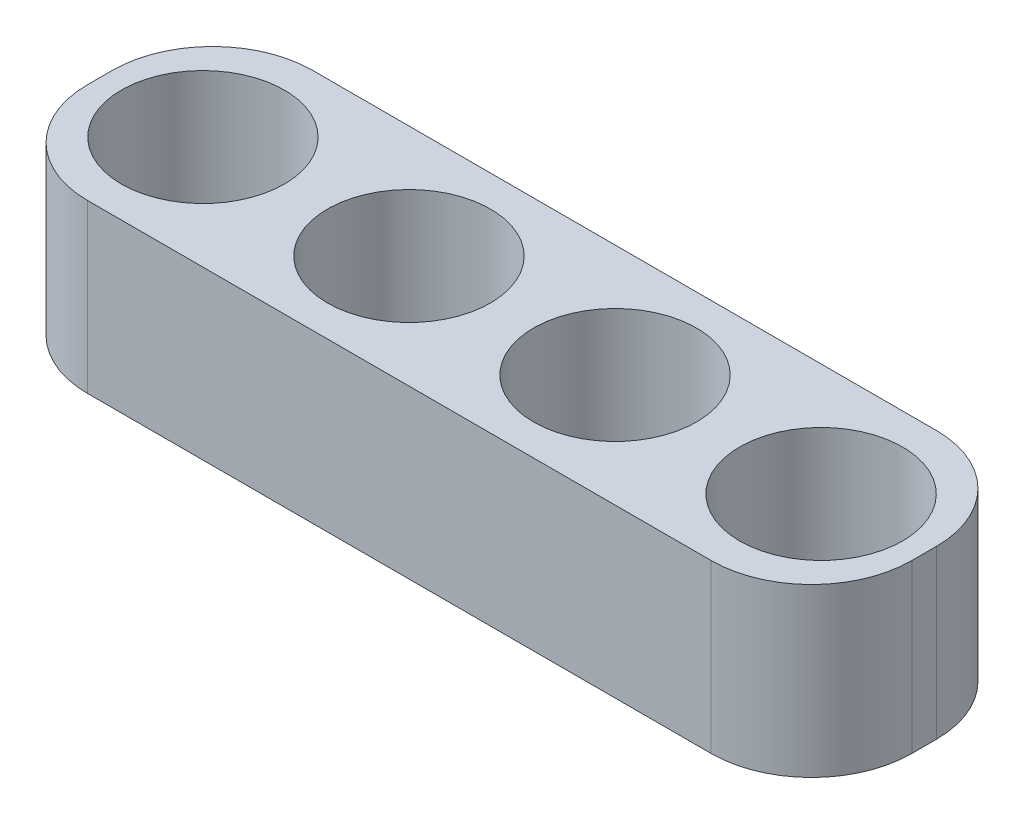
ISO-10303-21;
HEADER;
FILE_DESCRIPTION(('STEP AP214'),'2;1');
FILE_NAME('part.step','',(''),(''),'','','');
FILE_SCHEMA(('AUTOMOTIVE_DESIGN { 1 0 10303 214 1 1 1 1 }'));
ENDSEC;
DATA;
#1=APPLICATION_CONTEXT('core data for automotive mechanical design processes');
#2=APPLICATION_PROTOCOL_DEFINITION('international standard','automotive_design',2000,#1);
#3=PRODUCT_CONTEXT('',#1,'mechanical');
#4=PRODUCT('Part','Part','',(#3));
#5=PRODUCT_RELATED_PRODUCT_CATEGORY('part','',(#4));
#6=PRODUCT_DEFINITION_FORMATION('','',#4);
#7=PRODUCT_DEFINITION_CONTEXT('part definition',#1,'design');
#8=PRODUCT_DEFINITION('design','',#6,#7);
#9=PRODUCT_DEFINITION_SHAPE('','',#8);
#10=(LENGTH_UNIT() NAMED_UNIT(*) SI_UNIT(.MILLI.,.METRE.));
#11=(NAMED_UNIT(*) PLANE_ANGLE_UNIT() SI_UNIT($,.RADIAN.));
#12=(NAMED_UNIT(*) SI_UNIT($,.STERADIAN.) SOLID_ANGLE_UNIT());
#13=UNCERTAINTY_MEASURE_WITH_UNIT(LENGTH_MEASURE(1.E-05),#10,'distance_accuracy_value','');
#14=(GEOMETRIC_REPRESENTATION_CONTEXT(3) GLOBAL_UNCERTAINTY_ASSIGNED_CONTEXT((#13)) GLOBAL_UNIT_ASSIGNED_CONTEXT((#10,
#11,#12)) REPRESENTATION_CONTEXT('',''));
#15=CARTESIAN_POINT('',(0.,0.,0.));
#16=DIRECTION('',(0.,0.,1.));
#17=DIRECTION('',(1.,0.,0.));
#18=AXIS2_PLACEMENT_3D('',#15,#16,#17);
#19=CARTESIAN_POINT('',(0.,20.,13.4766099979274));
#20=DIRECTION('',(0.,0.,-1.));
#21=DIRECTION('',(-1.,0.,0.));
#22=AXIS2_PLACEMENT_3D('',#19,#20,#21);
#23=PLANE('',#22);
#24=DIRECTION('',(1.,0.,0.));
#25=VECTOR('',#24,1.);
#26=CARTESIAN_POINT('',(0.,0.,13.4766099979274));
#27=LINE('',#26,#25);
#28=CARTESIAN_POINT('',(-37.3186578647555,0.,13.4766099979274));
#29=VERTEX_POINT('',#28);
#30=CARTESIAN_POINT('',(37.3186578647554,0.,13.4766099979274));
#31=VERTEX_POINT('',#30);
#32=EDGE_CURVE('E138',#29,#31,#27,.T.);
#33=ORIENTED_EDGE('',*,*,#32,.T.);
#34=DIRECTION('',(0.,-1.,0.));
#35=VECTOR('',#34,1.);
#36=CARTESIAN_POINT('',(37.3186578647554,20.,13.4766099979274));
#37=LINE('',#36,#35);
#38=CARTESIAN_POINT('',(37.3186578647554,20.,13.4766099979274));
#39=VERTEX_POINT('',#38);
#40=EDGE_CURVE('E112',#31,#39,#37,.F.);
#41=ORIENTED_EDGE('',*,*,#40,.T.);
#42=DIRECTION('',(1.,0.,0.));
#43=VECTOR('',#42,1.);
#44=CARTESIAN_POINT('',(0.,20.,13.4766099979274));
#45=LINE('',#44,#43);
#46=CARTESIAN_POINT('',(-37.3186578647555,20.,13.4766099979274));
#47=VERTEX_POINT('',#46);
#48=EDGE_CURVE('E202',#47,#39,#45,.T.);
#49=ORIENTED_EDGE('',*,*,#48,.F.);
#50=DIRECTION('',(0.,-1.,0.));
#51=VECTOR('',#50,1.);
#52=CARTESIAN_POINT('',(-37.3186578647555,0.,13.4766099979274));
#53=LINE('',#52,#51);
#54=EDGE_CURVE('E118',#47,#29,#53,.T.);
#55=ORIENTED_EDGE('',*,*,#54,.T.);
#56=EDGE_LOOP('',(#33,#41,#49,#55));
#57=FACE_BOUND('',#56,.T.);
#58=ADVANCED_FACE('F41',(#57),#23,.F.);
#59=CARTESIAN_POINT('',(49.3186578647554,20.,0.));
#60=DIRECTION('',(-1.,0.,0.));
#61=DIRECTION('',(0.,0.,1.));
#62=AXIS2_PLACEMENT_3D('',#59,#60,#61);
#63=PLANE('',#62);
#64=DIRECTION('',(0.,0.,-1.));
#65=VECTOR('',#64,1.);
#66=CARTESIAN_POINT('',(49.3186578647554,20.,0.));
#67=LINE('',#66,#65);
#68=CARTESIAN_POINT('',(49.3186578647554,20.,1.47660999792736));
#69=VERTEX_POINT('',#68);
#70=CARTESIAN_POINT('',(49.3186578647554,20.,-1.47660999792736));
#71=VERTEX_POINT('',#70);
#72=EDGE_CURVE('E128',#69,#71,#67,.T.);
#73=ORIENTED_EDGE('',*,*,#72,.F.);
#74=DIRECTION('',(0.,-1.,0.));
#75=VECTOR('',#74,1.);
#76=CARTESIAN_POINT('',(49.3186578647554,20.,1.47660999792736));
#77=LINE('',#76,#75);
#78=CARTESIAN_POINT('',(49.3186578647554,0.,1.47660999792736));
#79=VERTEX_POINT('',#78);
#80=EDGE_CURVE('E111',#69,#79,#77,.T.);
#81=ORIENTED_EDGE('',*,*,#80,.T.);
#82=DIRECTION('',(0.,0.,-1.));
#83=VECTOR('',#82,1.);
#84=CARTESIAN_POINT('',(49.3186578647554,0.,0.));
#85=LINE('',#84,#83);
#86=CARTESIAN_POINT('',(49.3186578647554,0.,-1.47660999792736));
#87=VERTEX_POINT('',#86);
#88=EDGE_CURVE('E125',#79,#87,#85,.T.);
#89=ORIENTED_EDGE('',*,*,#88,.T.);
#90=DIRECTION('',(0.,-1.,0.));
#91=VECTOR('',#90,1.);
#92=CARTESIAN_POINT('',(49.3186578647554,20.,-1.47660999792736));
#93=LINE('',#92,#91);
#94=EDGE_CURVE('E131',#87,#71,#93,.F.);
#95=ORIENTED_EDGE('',*,*,#94,.T.);
#96=EDGE_LOOP('',(#73,#81,#89,#95));
#97=FACE_BOUND('',#96,.T.);
#98=ADVANCED_FACE('F124',(#97),#63,.F.);
#99=CARTESIAN_POINT('',(0.,20.,-13.4766099979274));
#100=DIRECTION('',(0.,0.,-1.));
#101=DIRECTION('',(-1.,0.,0.));
#102=AXIS2_PLACEMENT_3D('',#99,#100,#101);
#103=PLANE('',#102);
#104=DIRECTION('',(1.,0.,0.));
#105=VECTOR('',#104,1.);
#106=CARTESIAN_POINT('',(0.,20.,-13.4766099979274));
#107=LINE('',#106,#105);
#108=CARTESIAN_POINT('',(-37.3186578647555,20.,-13.4766099979274));
#109=VERTEX_POINT('',#108);
#110=CARTESIAN_POINT('',(37.3186578647554,20.,-13.4766099979274));
#111=VERTEX_POINT('',#110);
#112=EDGE_CURVE('E208',#109,#111,#107,.T.);
#113=ORIENTED_EDGE('',*,*,#112,.T.);
#114=DIRECTION('',(0.,-1.,0.));
#115=VECTOR('',#114,1.);
#116=CARTESIAN_POINT('',(37.3186578647554,0.,-13.4766099979274));
#117=LINE('',#116,#115);
#118=CARTESIAN_POINT('',(37.3186578647554,0.,-13.4766099979274));
#119=VERTEX_POINT('',#118);
#120=EDGE_CURVE('E185',#111,#119,#117,.T.);
#121=ORIENTED_EDGE('',*,*,#120,.T.);
#122=DIRECTION('',(1.,0.,0.));
#123=VECTOR('',#122,1.);
#124=CARTESIAN_POINT('',(0.,0.,-13.4766099979274));
#125=LINE('',#124,#123);
#126=CARTESIAN_POINT('',(-37.3186578647555,0.,-13.4766099979274));
#127=VERTEX_POINT('',#126);
#128=EDGE_CURVE('E137',#127,#119,#125,.T.);
#129=ORIENTED_EDGE('',*,*,#128,.F.);
#130=DIRECTION('',(0.,-1.,0.));
#131=VECTOR('',#130,1.);
#132=CARTESIAN_POINT('',(-37.3186578647555,20.,-13.4766099979274));
#133=LINE('',#132,#131);
#134=EDGE_CURVE('E182',#127,#109,#133,.F.);
#135=ORIENTED_EDGE('',*,*,#134,.T.);
#136=EDGE_LOOP('',(#113,#121,#129,#135));
#137=FACE_BOUND('',#136,.T.);
#138=ADVANCED_FACE('F247',(#137),#103,.T.);
#139=CARTESIAN_POINT('',(-49.3186578647555,20.,0.));
#140=DIRECTION('',(-1.,0.,0.));
#141=DIRECTION('',(0.,0.,1.));
#142=AXIS2_PLACEMENT_3D('',#139,#140,#141);
#143=PLANE('',#142);
#144=DIRECTION('',(0.,0.,-1.));
#145=VECTOR('',#144,1.);
#146=CARTESIAN_POINT('',(-49.3186578647555,0.,0.));
#147=LINE('',#146,#145);
#148=CARTESIAN_POINT('',(-49.3186578647555,0.,1.47660999792736));
#149=VERTEX_POINT('',#148);
#150=CARTESIAN_POINT('',(-49.3186578647555,0.,-1.47660999792736));
#151=VERTEX_POINT('',#150);
#152=EDGE_CURVE('E142',#149,#151,#147,.T.);
#153=ORIENTED_EDGE('',*,*,#152,.F.);
#154=DIRECTION('',(0.,-1.,0.));
#155=VECTOR('',#154,1.);
#156=CARTESIAN_POINT('',(-49.3186578647555,20.,1.47660999792736));
#157=LINE('',#156,#155);
#158=CARTESIAN_POINT('',(-49.3186578647555,20.,1.47660999792736));
#159=VERTEX_POINT('',#158);
#160=EDGE_CURVE('E11',#149,#159,#157,.F.);
#161=ORIENTED_EDGE('',*,*,#160,.T.);
#162=DIRECTION('',(0.,0.,-1.));
#163=VECTOR('',#162,1.);
#164=CARTESIAN_POINT('',(-49.3186578647555,20.,0.));
#165=LINE('',#164,#163);
#166=CARTESIAN_POINT('',(-49.3186578647555,20.,-1.47660999792736));
#167=VERTEX_POINT('',#166);
#168=EDGE_CURVE('E192',#159,#167,#165,.T.);
#169=ORIENTED_EDGE('',*,*,#168,.T.);
#170=DIRECTION('',(0.,-1.,0.));
#171=VECTOR('',#170,1.);
#172=CARTESIAN_POINT('',(-49.3186578647555,20.,-1.47660999792736));
#173=LINE('',#172,#171);
#174=EDGE_CURVE('E50',#167,#151,#173,.T.);
#175=ORIENTED_EDGE('',*,*,#174,.T.);
#176=EDGE_LOOP('',(#153,#161,#169,#175));
#177=FACE_BOUND('',#176,.T.);
#178=ADVANCED_FACE('F191',(#177),#143,.T.);
#179=CARTESIAN_POINT('',(-12.3296644661889,20.,0.));
#180=DIRECTION('',(0.,-1.,0.));
#181=DIRECTION('',(0.,0.,-1.));
#182=AXIS2_PLACEMENT_3D('',#179,#180,#181);
#183=CYLINDRICAL_SURFACE('',#182,9.75);
#184=CARTESIAN_POINT('',(-12.3296644661889,20.,0.));
#185=DIRECTION('',(0.,1.,0.));
#186=DIRECTION('',(0.,0.,1.));
#187=AXIS2_PLACEMENT_3D('',#184,#185,#186);
#188=CIRCLE('',#187,9.75);
#189=CARTESIAN_POINT('',(-12.3296644661889,20.,9.75));
#190=VERTEX_POINT('',#189);
#191=EDGE_CURVE('E204',#190,#190,#188,.T.);
#192=ORIENTED_EDGE('',*,*,#191,.T.);
#193=EDGE_LOOP('',(#192));
#194=FACE_BOUND('',#193,.T.);
#195=CARTESIAN_POINT('',(-12.3296644661889,0.,0.));
#196=DIRECTION('',(0.,1.,0.));
#197=DIRECTION('',(0.,0.,1.));
#198=AXIS2_PLACEMENT_3D('',#195,#196,#197);
#199=CIRCLE('',#198,9.75);
#200=CARTESIAN_POINT('',(-12.3296644661889,0.,9.75));
#201=VERTEX_POINT('',#200);
#202=EDGE_CURVE('E144',#201,#201,#199,.T.);
#203=ORIENTED_EDGE('',*,*,#202,.F.);
#204=EDGE_LOOP('',(#203));
#205=FACE_BOUND('',#204,.T.);
#206=ADVANCED_FACE('F235',(#194,#205),#183,.F.);
#207=CARTESIAN_POINT('',(12.3296644661889,20.,0.));
#208=DIRECTION('',(0.,-1.,0.));
#209=DIRECTION('',(0.,0.,-1.));
#210=AXIS2_PLACEMENT_3D('',#207,#208,#209);
#211=CYLINDRICAL_SURFACE('',#210,9.75);
#212=CARTESIAN_POINT('',(12.3296644661889,20.,0.));
#213=DIRECTION('',(0.,1.,0.));
#214=DIRECTION('',(0.,0.,1.));
#215=AXIS2_PLACEMENT_3D('',#212,#213,#214);
#216=CIRCLE('',#215,9.75);
#217=CARTESIAN_POINT('',(12.3296644661889,20.,9.75));
#218=VERTEX_POINT('',#217);
#219=EDGE_CURVE('E211',#218,#218,#216,.T.);
#220=ORIENTED_EDGE('',*,*,#219,.T.);
#221=EDGE_LOOP('',(#220));
#222=FACE_BOUND('',#221,.T.);
#223=CARTESIAN_POINT('',(12.3296644661889,0.,0.));
#224=DIRECTION('',(0.,1.,0.));
#225=DIRECTION('',(0.,0.,1.));
#226=AXIS2_PLACEMENT_3D('',#223,#224,#225);
#227=CIRCLE('',#226,9.75);
#228=CARTESIAN_POINT('',(12.3296644661889,0.,9.75));
#229=VERTEX_POINT('',#228);
#230=EDGE_CURVE('E227',#229,#229,#227,.T.);
#231=ORIENTED_EDGE('',*,*,#230,.F.);
#232=EDGE_LOOP('',(#231));
#233=FACE_BOUND('',#232,.T.);
#234=ADVANCED_FACE('F237',(#222,#233),#211,.F.);
#235=CARTESIAN_POINT('',(36.9889933985666,20.,0.));
#236=DIRECTION('',(0.,-1.,0.));
#237=DIRECTION('',(0.,0.,-1.));
#238=AXIS2_PLACEMENT_3D('',#235,#236,#237);
#239=CYLINDRICAL_SURFACE('',#238,9.75);
#240=CARTESIAN_POINT('',(36.9889933985666,20.,0.));
#241=DIRECTION('',(0.,1.,0.));
#242=DIRECTION('',(0.,0.,1.));
#243=AXIS2_PLACEMENT_3D('',#240,#241,#242);
#244=CIRCLE('',#243,9.75);
#245=CARTESIAN_POINT('',(36.9889933985666,20.,9.75));
#246=VERTEX_POINT('',#245);
#247=EDGE_CURVE('E155',#246,#246,#244,.T.);
#248=ORIENTED_EDGE('',*,*,#247,.T.);
#249=EDGE_LOOP('',(#248));
#250=FACE_BOUND('',#249,.T.);
#251=CARTESIAN_POINT('',(36.9889933985666,0.,0.));
#252=DIRECTION('',(0.,1.,0.));
#253=DIRECTION('',(0.,0.,1.));
#254=AXIS2_PLACEMENT_3D('',#251,#252,#253);
#255=CIRCLE('',#254,9.75);
#256=CARTESIAN_POINT('',(36.9889933985666,0.,9.75));
#257=VERTEX_POINT('',#256);
#258=EDGE_CURVE('E223',#257,#257,#255,.T.);
#259=ORIENTED_EDGE('',*,*,#258,.F.);
#260=EDGE_LOOP('',(#259));
#261=FACE_BOUND('',#260,.T.);
#262=ADVANCED_FACE('F244',(#250,#261),#239,.F.);
#263=CARTESIAN_POINT('',(-36.9889933985666,20.,0.));
#264=DIRECTION('',(0.,-1.,0.));
#265=DIRECTION('',(0.,0.,-1.));
#266=AXIS2_PLACEMENT_3D('',#263,#264,#265);
#267=CYLINDRICAL_SURFACE('',#266,9.75);
#268=CARTESIAN_POINT('',(-36.9889933985666,20.,0.));
#269=DIRECTION('',(0.,1.,0.));
#270=DIRECTION('',(0.,0.,1.));
#271=AXIS2_PLACEMENT_3D('',#268,#269,#270);
#272=CIRCLE('',#271,9.75);
#273=CARTESIAN_POINT('',(-36.9889933985666,20.,9.75));
#274=VERTEX_POINT('',#273);
#275=EDGE_CURVE('E157',#274,#274,#272,.T.);
#276=ORIENTED_EDGE('',*,*,#275,.T.);
#277=EDGE_LOOP('',(#276));
#278=FACE_BOUND('',#277,.T.);
#279=CARTESIAN_POINT('',(-36.9889933985666,0.,0.));
#280=DIRECTION('',(0.,1.,0.));
#281=DIRECTION('',(0.,0.,1.));
#282=AXIS2_PLACEMENT_3D('',#279,#280,#281);
#283=CIRCLE('',#282,9.75);
#284=CARTESIAN_POINT('',(-36.9889933985666,0.,9.75));
#285=VERTEX_POINT('',#284);
#286=EDGE_CURVE('E151',#285,#285,#283,.T.);
#287=ORIENTED_EDGE('',*,*,#286,.F.);
#288=EDGE_LOOP('',(#287));
#289=FACE_BOUND('',#288,.T.);
#290=ADVANCED_FACE('F259',(#278,#289),#267,.F.);
#291=CARTESIAN_POINT('',(0.,20.,0.));
#292=DIRECTION('',(0.,1.,0.));
#293=DIRECTION('',(0.,0.,1.));
#294=AXIS2_PLACEMENT_3D('',#291,#292,#293);
#295=PLANE('',#294);
#296=ORIENTED_EDGE('',*,*,#247,.F.);
#297=EDGE_LOOP('',(#296));
#298=FACE_BOUND('',#297,.T.);
#299=ORIENTED_EDGE('',*,*,#219,.F.);
#300=EDGE_LOOP('',(#299));
#301=FACE_BOUND('',#300,.T.);
#302=ORIENTED_EDGE('',*,*,#191,.F.);
#303=EDGE_LOOP('',(#302));
#304=FACE_BOUND('',#303,.T.);
#305=ORIENTED_EDGE('',*,*,#48,.T.);
#306=CARTESIAN_POINT('',(37.3186578647554,20.,1.47660999792736));
#307=DIRECTION('',(0.,1.,0.));
#308=DIRECTION('',(0.,0.,1.));
#309=AXIS2_PLACEMENT_3D('',#306,#307,#308);
#310=CIRCLE('',#309,12.);
#311=EDGE_CURVE('E179',#39,#69,#310,.T.);
#312=ORIENTED_EDGE('',*,*,#311,.T.);
#313=ORIENTED_EDGE('',*,*,#72,.T.);
#314=CARTESIAN_POINT('',(37.3186578647554,20.,-1.47660999792736));
#315=DIRECTION('',(0.,1.,0.));
#316=DIRECTION('',(0.,0.,1.));
#317=AXIS2_PLACEMENT_3D('',#314,#315,#316);
#318=CIRCLE('',#317,12.);
#319=EDGE_CURVE('E176',#71,#111,#318,.T.);
#320=ORIENTED_EDGE('',*,*,#319,.T.);
#321=ORIENTED_EDGE('',*,*,#112,.F.);
#322=CARTESIAN_POINT('',(-37.3186578647555,20.,-1.47660999792736));
#323=DIRECTION('',(0.,1.,0.));
#324=DIRECTION('',(0.,0.,1.));
#325=AXIS2_PLACEMENT_3D('',#322,#323,#324);
#326=CIRCLE('',#325,12.);
#327=EDGE_CURVE('E57',#109,#167,#326,.T.);
#328=ORIENTED_EDGE('',*,*,#327,.T.);
#329=ORIENTED_EDGE('',*,*,#168,.F.);
#330=CARTESIAN_POINT('',(-37.3186578647555,20.,1.47660999792736));
#331=DIRECTION('',(0.,1.,0.));
#332=DIRECTION('',(0.,0.,1.));
#333=AXIS2_PLACEMENT_3D('',#330,#331,#332);
#334=CIRCLE('',#333,12.);
#335=EDGE_CURVE('E173',#159,#47,#334,.T.);
#336=ORIENTED_EDGE('',*,*,#335,.T.);
#337=EDGE_LOOP('',(#305,#312,#313,#320,#321,#328,#329,#336));
#338=FACE_BOUND('',#337,.T.);
#339=ORIENTED_EDGE('',*,*,#275,.F.);
#340=EDGE_LOOP('',(#339));
#341=FACE_BOUND('',#340,.T.);
#342=ADVANCED_FACE('F262',(#298,#301,#304,#338,#341),#295,.T.);
#343=CARTESIAN_POINT('',(0.,0.,0.));
#344=DIRECTION('',(0.,1.,0.));
#345=DIRECTION('',(0.,0.,1.));
#346=AXIS2_PLACEMENT_3D('',#343,#344,#345);
#347=PLANE('',#346);
#348=ORIENTED_EDGE('',*,*,#258,.T.);
#349=EDGE_LOOP('',(#348));
#350=FACE_BOUND('',#349,.T.);
#351=ORIENTED_EDGE('',*,*,#230,.T.);
#352=EDGE_LOOP('',(#351));
#353=FACE_BOUND('',#352,.T.);
#354=ORIENTED_EDGE('',*,*,#202,.T.);
#355=EDGE_LOOP('',(#354));
#356=FACE_BOUND('',#355,.T.);
#357=ORIENTED_EDGE('',*,*,#88,.F.);
#358=CARTESIAN_POINT('',(37.3186578647554,0.,1.47660999792736));
#359=DIRECTION('',(0.,1.,0.));
#360=DIRECTION('',(0.,0.,1.));
#361=AXIS2_PLACEMENT_3D('',#358,#359,#360);
#362=CIRCLE('',#361,12.);
#363=EDGE_CURVE('E107',#79,#31,#362,.F.);
#364=ORIENTED_EDGE('',*,*,#363,.T.);
#365=ORIENTED_EDGE('',*,*,#32,.F.);
#366=CARTESIAN_POINT('',(-37.3186578647555,0.,1.47660999792736));
#367=DIRECTION('',(0.,1.,0.));
#368=DIRECTION('',(0.,0.,1.));
#369=AXIS2_PLACEMENT_3D('',#366,#367,#368);
#370=CIRCLE('',#369,12.);
#371=EDGE_CURVE('E161',#29,#149,#370,.F.);
#372=ORIENTED_EDGE('',*,*,#371,.T.);
#373=ORIENTED_EDGE('',*,*,#152,.T.);
#374=CARTESIAN_POINT('',(-37.3186578647555,0.,-1.47660999792736));
#375=DIRECTION('',(0.,1.,0.));
#376=DIRECTION('',(0.,0.,1.));
#377=AXIS2_PLACEMENT_3D('',#374,#375,#376);
#378=CIRCLE('',#377,12.);
#379=EDGE_CURVE('E130',#151,#127,#378,.F.);
#380=ORIENTED_EDGE('',*,*,#379,.T.);
#381=ORIENTED_EDGE('',*,*,#128,.T.);
#382=CARTESIAN_POINT('',(37.3186578647554,0.,-1.47660999792736));
#383=DIRECTION('',(0.,1.,0.));
#384=DIRECTION('',(0.,0.,1.));
#385=AXIS2_PLACEMENT_3D('',#382,#383,#384);
#386=CIRCLE('',#385,12.);
#387=EDGE_CURVE('E119',#119,#87,#386,.F.);
#388=ORIENTED_EDGE('',*,*,#387,.T.);
#389=EDGE_LOOP('',(#357,#364,#365,#372,#373,#380,#381,#388));
#390=FACE_BOUND('',#389,.T.);
#391=ORIENTED_EDGE('',*,*,#286,.T.);
#392=EDGE_LOOP('',(#391));
#393=FACE_BOUND('',#392,.T.);
#394=ADVANCED_FACE('F133',(#350,#353,#356,#390,#393),#347,.F.);
#395=CARTESIAN_POINT('',(37.3186578647554,20.,1.47660999792736));
#396=DIRECTION('',(0.,-1.,0.));
#397=DIRECTION('',(0.,0.,-1.));
#398=AXIS2_PLACEMENT_3D('',#395,#396,#397);
#399=CYLINDRICAL_SURFACE('',#398,12.);
#400=ORIENTED_EDGE('',*,*,#311,.F.);
#401=ORIENTED_EDGE('',*,*,#40,.F.);
#402=ORIENTED_EDGE('',*,*,#363,.F.);
#403=ORIENTED_EDGE('',*,*,#80,.F.);
#404=EDGE_LOOP('',(#400,#401,#402,#403));
#405=FACE_BOUND('',#404,.T.);
#406=ADVANCED_FACE('F110',(#405),#399,.T.);
#407=CARTESIAN_POINT('',(37.3186578647554,20.,-1.47660999792736));
#408=DIRECTION('',(0.,1.,0.));
#409=DIRECTION('',(0.,0.,1.));
#410=AXIS2_PLACEMENT_3D('',#407,#408,#409);
#411=CYLINDRICAL_SURFACE('',#410,12.);
#412=ORIENTED_EDGE('',*,*,#319,.F.);
#413=ORIENTED_EDGE('',*,*,#94,.F.);
#414=ORIENTED_EDGE('',*,*,#387,.F.);
#415=ORIENTED_EDGE('',*,*,#120,.F.);
#416=EDGE_LOOP('',(#412,#413,#414,#415));
#417=FACE_BOUND('',#416,.T.);
#418=ADVANCED_FACE('F298',(#417),#411,.T.);
#419=CARTESIAN_POINT('',(-37.3186578647555,20.,1.47660999792736));
#420=DIRECTION('',(0.,1.,0.));
#421=DIRECTION('',(0.,0.,1.));
#422=AXIS2_PLACEMENT_3D('',#419,#420,#421);
#423=CYLINDRICAL_SURFACE('',#422,12.);
#424=ORIENTED_EDGE('',*,*,#335,.F.);
#425=ORIENTED_EDGE('',*,*,#160,.F.);
#426=ORIENTED_EDGE('',*,*,#371,.F.);
#427=ORIENTED_EDGE('',*,*,#54,.F.);
#428=EDGE_LOOP('',(#424,#425,#426,#427));
#429=FACE_BOUND('',#428,.T.);
#430=ADVANCED_FACE('F198',(#429),#423,.T.);
#431=CARTESIAN_POINT('',(-37.3186578647555,20.,-1.47660999792736));
#432=DIRECTION('',(0.,-1.,0.));
#433=DIRECTION('',(0.,0.,-1.));
#434=AXIS2_PLACEMENT_3D('',#431,#432,#433);
#435=CYLINDRICAL_SURFACE('',#434,12.);
#436=ORIENTED_EDGE('',*,*,#327,.F.);
#437=ORIENTED_EDGE('',*,*,#134,.F.);
#438=ORIENTED_EDGE('',*,*,#379,.F.);
#439=ORIENTED_EDGE('',*,*,#174,.F.);
#440=EDGE_LOOP('',(#436,#437,#438,#439));
#441=FACE_BOUND('',#440,.T.);
#442=ADVANCED_FACE('F43',(#441),#435,.T.);
#443=CLOSED_SHELL('',(#58,#98,#138,#178,#206,#234,#262,#290,#342,#394,#406,#418,#430,#442));
#444=MANIFOLD_SOLID_BREP('B2',#443);
#445=ADVANCED_BREP_SHAPE_REPRESENTATION('',(#18,#444),#14);
#446=SHAPE_DEFINITION_REPRESENTATION(#9,#445);
ENDSEC;
END-ISO-10303-21;
